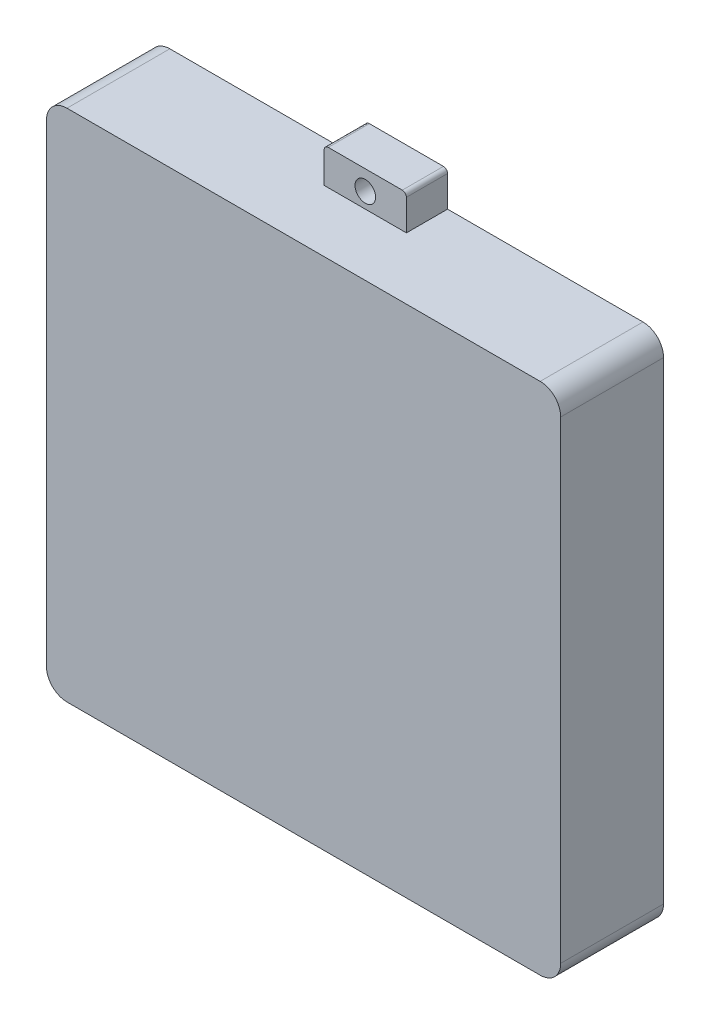
ISO-10303-21;
HEADER;
FILE_DESCRIPTION(('STEP AP214'),'2;1');
FILE_NAME('part.step','',(''),(''),'','','');
FILE_SCHEMA(('AUTOMOTIVE_DESIGN { 1 0 10303 214 1 1 1 1 }'));
ENDSEC;
DATA;
#1=APPLICATION_CONTEXT('core data for automotive mechanical design processes');
#2=APPLICATION_PROTOCOL_DEFINITION('international standard','automotive_design',2000,#1);
#3=PRODUCT_CONTEXT('',#1,'mechanical');
#4=PRODUCT('Part','Part','',(#3));
#5=PRODUCT_RELATED_PRODUCT_CATEGORY('part','',(#4));
#6=PRODUCT_DEFINITION_FORMATION('','',#4);
#7=PRODUCT_DEFINITION_CONTEXT('part definition',#1,'design');
#8=PRODUCT_DEFINITION('design','',#6,#7);
#9=PRODUCT_DEFINITION_SHAPE('','',#8);
#10=(LENGTH_UNIT() NAMED_UNIT(*) SI_UNIT(.MILLI.,.METRE.));
#11=(NAMED_UNIT(*) PLANE_ANGLE_UNIT() SI_UNIT($,.RADIAN.));
#12=(NAMED_UNIT(*) SI_UNIT($,.STERADIAN.) SOLID_ANGLE_UNIT());
#13=UNCERTAINTY_MEASURE_WITH_UNIT(LENGTH_MEASURE(1.E-05),#10,'distance_accuracy_value','');
#14=(GEOMETRIC_REPRESENTATION_CONTEXT(3) GLOBAL_UNCERTAINTY_ASSIGNED_CONTEXT((#13)) GLOBAL_UNIT_ASSIGNED_CONTEXT((#10,
#11,#12)) REPRESENTATION_CONTEXT('',''));
#15=CARTESIAN_POINT('',(0.,0.,0.));
#16=DIRECTION('',(0.,0.,1.));
#17=DIRECTION('',(1.,0.,0.));
#18=AXIS2_PLACEMENT_3D('',#15,#16,#17);
#19=CARTESIAN_POINT('',(0.,250.,50.));
#20=DIRECTION('',(0.,-1.,0.));
#21=DIRECTION('',(0.,0.,-1.));
#22=AXIS2_PLACEMENT_3D('',#19,#20,#21);
#23=PLANE('',#22);
#24=DIRECTION('',(-1.,0.,0.));
#25=VECTOR('',#24,1.);
#26=CARTESIAN_POINT('',(0.,250.,50.));
#27=LINE('',#26,#25);
#28=CARTESIAN_POINT('',(240.,250.,50.));
#29=VERTEX_POINT('',#28);
#30=CARTESIAN_POINT('',(10.,250.,50.));
#31=VERTEX_POINT('',#30);
#32=EDGE_CURVE('E336',#29,#31,#27,.T.);
#33=ORIENTED_EDGE('',*,*,#32,.F.);
#34=DIRECTION('',(0.,0.,-1.));
#35=VECTOR('',#34,1.);
#36=CARTESIAN_POINT('',(240.,250.,50.));
#37=LINE('',#36,#35);
#38=CARTESIAN_POINT('',(240.,250.,0.));
#39=VERTEX_POINT('',#38);
#40=EDGE_CURVE('E367',#29,#39,#37,.T.);
#41=ORIENTED_EDGE('',*,*,#40,.T.);
#42=DIRECTION('',(-1.,0.,0.));
#43=VECTOR('',#42,1.);
#44=CARTESIAN_POINT('',(0.,250.,0.));
#45=LINE('',#44,#43);
#46=CARTESIAN_POINT('',(145.,250.,0.));
#47=VERTEX_POINT('',#46);
#48=EDGE_CURVE('E257',#39,#47,#45,.T.);
#49=ORIENTED_EDGE('',*,*,#48,.T.);
#50=DIRECTION('',(0.,0.,-1.));
#51=VECTOR('',#50,1.);
#52=CARTESIAN_POINT('',(145.,250.,20.));
#53=LINE('',#52,#51);
#54=CARTESIAN_POINT('',(145.,250.,20.));
#55=VERTEX_POINT('',#54);
#56=EDGE_CURVE('E248',#55,#47,#53,.T.);
#57=ORIENTED_EDGE('',*,*,#56,.F.);
#58=DIRECTION('',(-1.,0.,0.));
#59=VECTOR('',#58,1.);
#60=CARTESIAN_POINT('',(145.,250.,20.));
#61=LINE('',#60,#59);
#62=CARTESIAN_POINT('',(105.,250.,20.));
#63=VERTEX_POINT('',#62);
#64=EDGE_CURVE('E229',#55,#63,#61,.T.);
#65=ORIENTED_EDGE('',*,*,#64,.T.);
#66=DIRECTION('',(0.,0.,-1.));
#67=VECTOR('',#66,1.);
#68=CARTESIAN_POINT('',(105.,250.,20.));
#69=LINE('',#68,#67);
#70=CARTESIAN_POINT('',(105.,250.,0.));
#71=VERTEX_POINT('',#70);
#72=EDGE_CURVE('E523',#63,#71,#69,.T.);
#73=ORIENTED_EDGE('',*,*,#72,.T.);
#74=CARTESIAN_POINT('',(10.,250.,0.));
#75=VERTEX_POINT('',#74);
#76=EDGE_CURVE('E352',#71,#75,#45,.T.);
#77=ORIENTED_EDGE('',*,*,#76,.T.);
#78=DIRECTION('',(0.,0.,-1.));
#79=VECTOR('',#78,1.);
#80=CARTESIAN_POINT('',(10.,250.,50.));
#81=LINE('',#80,#79);
#82=EDGE_CURVE('E340',#75,#31,#81,.F.);
#83=ORIENTED_EDGE('',*,*,#82,.T.);
#84=EDGE_LOOP('',(#33,#41,#49,#57,#65,#73,#77,#83));
#85=FACE_BOUND('',#84,.T.);
#86=ADVANCED_FACE('F43',(#85),#23,.F.);
#87=CARTESIAN_POINT('',(0.,0.,50.));
#88=DIRECTION('',(0.,1.,0.));
#89=DIRECTION('',(0.,0.,1.));
#90=AXIS2_PLACEMENT_3D('',#87,#88,#89);
#91=PLANE('',#90);
#92=DIRECTION('',(1.,0.,0.));
#93=VECTOR('',#92,1.);
#94=CARTESIAN_POINT('',(0.,0.,0.));
#95=LINE('',#94,#93);
#96=CARTESIAN_POINT('',(145.,0.,0.));
#97=VERTEX_POINT('',#96);
#98=CARTESIAN_POINT('',(240.,0.,0.));
#99=VERTEX_POINT('',#98);
#100=EDGE_CURVE('E344',#97,#99,#95,.T.);
#101=ORIENTED_EDGE('',*,*,#100,.T.);
#102=DIRECTION('',(0.,0.,-1.));
#103=VECTOR('',#102,1.);
#104=CARTESIAN_POINT('',(240.,0.,50.));
#105=LINE('',#104,#103);
#106=CARTESIAN_POINT('',(240.,0.,50.));
#107=VERTEX_POINT('',#106);
#108=EDGE_CURVE('E405',#99,#107,#105,.F.);
#109=ORIENTED_EDGE('',*,*,#108,.T.);
#110=DIRECTION('',(1.,0.,0.));
#111=VECTOR('',#110,1.);
#112=CARTESIAN_POINT('',(0.,0.,50.));
#113=LINE('',#112,#111);
#114=CARTESIAN_POINT('',(10.,0.,50.));
#115=VERTEX_POINT('',#114);
#116=EDGE_CURVE('E328',#115,#107,#113,.T.);
#117=ORIENTED_EDGE('',*,*,#116,.F.);
#118=DIRECTION('',(0.,0.,-1.));
#119=VECTOR('',#118,1.);
#120=CARTESIAN_POINT('',(10.,0.,50.));
#121=LINE('',#120,#119);
#122=CARTESIAN_POINT('',(10.,0.,0.));
#123=VERTEX_POINT('',#122);
#124=EDGE_CURVE('E401',#115,#123,#121,.T.);
#125=ORIENTED_EDGE('',*,*,#124,.T.);
#126=CARTESIAN_POINT('',(105.,0.,0.));
#127=VERTEX_POINT('',#126);
#128=EDGE_CURVE('E345',#123,#127,#95,.T.);
#129=ORIENTED_EDGE('',*,*,#128,.T.);
#130=DIRECTION('',(0.,0.,-1.));
#131=VECTOR('',#130,1.);
#132=CARTESIAN_POINT('',(105.,0.,20.));
#133=LINE('',#132,#131);
#134=CARTESIAN_POINT('',(105.,0.,20.));
#135=VERTEX_POINT('',#134);
#136=EDGE_CURVE('E319',#135,#127,#133,.T.);
#137=ORIENTED_EDGE('',*,*,#136,.F.);
#138=DIRECTION('',(-1.,0.,0.));
#139=VECTOR('',#138,1.);
#140=CARTESIAN_POINT('',(145.,0.,20.));
#141=LINE('',#140,#139);
#142=CARTESIAN_POINT('',(145.,0.,20.));
#143=VERTEX_POINT('',#142);
#144=EDGE_CURVE('E269',#143,#135,#141,.T.);
#145=ORIENTED_EDGE('',*,*,#144,.F.);
#146=DIRECTION('',(0.,0.,-1.));
#147=VECTOR('',#146,1.);
#148=CARTESIAN_POINT('',(145.,0.,20.));
#149=LINE('',#148,#147);
#150=EDGE_CURVE('E288',#143,#97,#149,.T.);
#151=ORIENTED_EDGE('',*,*,#150,.T.);
#152=EDGE_LOOP('',(#101,#109,#117,#125,#129,#137,#145,#151));
#153=FACE_BOUND('',#152,.T.);
#154=ADVANCED_FACE('F572',(#153),#91,.F.);
#155=CARTESIAN_POINT('',(0.,0.,50.));
#156=DIRECTION('',(1.,0.,0.));
#157=DIRECTION('',(0.,0.,-1.));
#158=AXIS2_PLACEMENT_3D('',#155,#156,#157);
#159=PLANE('',#158);
#160=DIRECTION('',(0.,-1.,0.));
#161=VECTOR('',#160,1.);
#162=CARTESIAN_POINT('',(0.,0.,0.));
#163=LINE('',#162,#161);
#164=CARTESIAN_POINT('',(0.,240.,0.));
#165=VERTEX_POINT('',#164);
#166=CARTESIAN_POINT('',(0.,10.,0.));
#167=VERTEX_POINT('',#166);
#168=EDGE_CURVE('E323',#165,#167,#163,.T.);
#169=ORIENTED_EDGE('',*,*,#168,.T.);
#170=DIRECTION('',(0.,0.,-1.));
#171=VECTOR('',#170,1.);
#172=CARTESIAN_POINT('',(0.,10.,50.));
#173=LINE('',#172,#171);
#174=CARTESIAN_POINT('',(0.,10.,50.));
#175=VERTEX_POINT('',#174);
#176=EDGE_CURVE('E412',#167,#175,#173,.F.);
#177=ORIENTED_EDGE('',*,*,#176,.T.);
#178=DIRECTION('',(0.,-1.,0.));
#179=VECTOR('',#178,1.);
#180=CARTESIAN_POINT('',(0.,0.,50.));
#181=LINE('',#180,#179);
#182=CARTESIAN_POINT('',(0.,240.,50.));
#183=VERTEX_POINT('',#182);
#184=EDGE_CURVE('E324',#183,#175,#181,.T.);
#185=ORIENTED_EDGE('',*,*,#184,.F.);
#186=DIRECTION('',(0.,0.,-1.));
#187=VECTOR('',#186,1.);
#188=CARTESIAN_POINT('',(0.,240.,50.));
#189=LINE('',#188,#187);
#190=EDGE_CURVE('E408',#183,#165,#189,.T.);
#191=ORIENTED_EDGE('',*,*,#190,.T.);
#192=EDGE_LOOP('',(#169,#177,#185,#191));
#193=FACE_BOUND('',#192,.T.);
#194=ADVANCED_FACE('F599',(#193),#159,.F.);
#195=CARTESIAN_POINT('',(250.,0.,50.));
#196=DIRECTION('',(-1.,0.,0.));
#197=DIRECTION('',(0.,0.,1.));
#198=AXIS2_PLACEMENT_3D('',#195,#196,#197);
#199=PLANE('',#198);
#200=DIRECTION('',(0.,1.,0.));
#201=VECTOR('',#200,1.);
#202=CARTESIAN_POINT('',(250.,0.,0.));
#203=LINE('',#202,#201);
#204=CARTESIAN_POINT('',(250.,10.,0.));
#205=VERTEX_POINT('',#204);
#206=CARTESIAN_POINT('',(250.,240.,0.));
#207=VERTEX_POINT('',#206);
#208=EDGE_CURVE('E348',#205,#207,#203,.T.);
#209=ORIENTED_EDGE('',*,*,#208,.T.);
#210=DIRECTION('',(0.,0.,-1.));
#211=VECTOR('',#210,1.);
#212=CARTESIAN_POINT('',(250.,240.,50.));
#213=LINE('',#212,#211);
#214=CARTESIAN_POINT('',(250.,240.,50.));
#215=VERTEX_POINT('',#214);
#216=EDGE_CURVE('E386',#207,#215,#213,.F.);
#217=ORIENTED_EDGE('',*,*,#216,.T.);
#218=DIRECTION('',(0.,1.,0.));
#219=VECTOR('',#218,1.);
#220=CARTESIAN_POINT('',(250.,0.,50.));
#221=LINE('',#220,#219);
#222=CARTESIAN_POINT('',(250.,10.,50.));
#223=VERTEX_POINT('',#222);
#224=EDGE_CURVE('E332',#223,#215,#221,.T.);
#225=ORIENTED_EDGE('',*,*,#224,.F.);
#226=DIRECTION('',(0.,0.,-1.));
#227=VECTOR('',#226,1.);
#228=CARTESIAN_POINT('',(250.,10.,50.));
#229=LINE('',#228,#227);
#230=EDGE_CURVE('E382',#223,#205,#229,.T.);
#231=ORIENTED_EDGE('',*,*,#230,.T.);
#232=EDGE_LOOP('',(#209,#217,#225,#231));
#233=FACE_BOUND('',#232,.T.);
#234=ADVANCED_FACE('F586',(#233),#199,.F.);
#235=CARTESIAN_POINT('',(0.,0.,50.));
#236=DIRECTION('',(0.,0.,-1.));
#237=DIRECTION('',(-1.,0.,0.));
#238=AXIS2_PLACEMENT_3D('',#235,#236,#237);
#239=PLANE('',#238);
#240=ORIENTED_EDGE('',*,*,#224,.T.);
#241=CARTESIAN_POINT('',(240.,240.,50.));
#242=DIRECTION('',(0.,0.,-1.));
#243=DIRECTION('',(-1.,0.,0.));
#244=AXIS2_PLACEMENT_3D('',#241,#242,#243);
#245=CIRCLE('',#244,10.);
#246=EDGE_CURVE('E398',#215,#29,#245,.F.);
#247=ORIENTED_EDGE('',*,*,#246,.T.);
#248=ORIENTED_EDGE('',*,*,#32,.T.);
#249=CARTESIAN_POINT('',(10.,240.,50.));
#250=DIRECTION('',(0.,0.,-1.));
#251=DIRECTION('',(-1.,0.,0.));
#252=AXIS2_PLACEMENT_3D('',#249,#250,#251);
#253=CIRCLE('',#252,10.);
#254=EDGE_CURVE('E389',#31,#183,#253,.F.);
#255=ORIENTED_EDGE('',*,*,#254,.T.);
#256=ORIENTED_EDGE('',*,*,#184,.T.);
#257=CARTESIAN_POINT('',(10.,10.,50.));
#258=DIRECTION('',(0.,0.,-1.));
#259=DIRECTION('',(-1.,0.,0.));
#260=AXIS2_PLACEMENT_3D('',#257,#258,#259);
#261=CIRCLE('',#260,10.);
#262=EDGE_CURVE('E392',#175,#115,#261,.F.);
#263=ORIENTED_EDGE('',*,*,#262,.T.);
#264=ORIENTED_EDGE('',*,*,#116,.T.);
#265=CARTESIAN_POINT('',(240.,10.,50.));
#266=DIRECTION('',(0.,0.,-1.));
#267=DIRECTION('',(-1.,0.,0.));
#268=AXIS2_PLACEMENT_3D('',#265,#266,#267);
#269=CIRCLE('',#268,10.);
#270=EDGE_CURVE('E395',#107,#223,#269,.F.);
#271=ORIENTED_EDGE('',*,*,#270,.T.);
#272=EDGE_LOOP('',(#240,#247,#248,#255,#256,#263,#264,#271));
#273=FACE_BOUND('',#272,.T.);
#274=ADVANCED_FACE('F583',(#273),#239,.F.);
#275=CARTESIAN_POINT('',(0.,0.,0.));
#276=DIRECTION('',(0.,0.,-1.));
#277=DIRECTION('',(-1.,0.,0.));
#278=AXIS2_PLACEMENT_3D('',#275,#276,#277);
#279=PLANE('',#278);
#280=DIRECTION('',(1.,0.,0.));
#281=VECTOR('',#280,1.);
#282=CARTESIAN_POINT('',(246.,246.,0.));
#283=LINE('',#282,#281);
#284=CARTESIAN_POINT('',(14.,246.,0.));
#285=VERTEX_POINT('',#284);
#286=CARTESIAN_POINT('',(236.,246.,0.));
#287=VERTEX_POINT('',#286);
#288=EDGE_CURVE('E498',#285,#287,#283,.T.);
#289=ORIENTED_EDGE('',*,*,#288,.F.);
#290=CARTESIAN_POINT('',(14.,236.,0.));
#291=DIRECTION('',(0.,0.,-1.));
#292=DIRECTION('',(-1.,0.,0.));
#293=AXIS2_PLACEMENT_3D('',#290,#291,#292);
#294=CIRCLE('',#293,10.);
#295=CARTESIAN_POINT('',(4.,236.,0.));
#296=VERTEX_POINT('',#295);
#297=EDGE_CURVE('E11',#285,#296,#294,.F.);
#298=ORIENTED_EDGE('',*,*,#297,.T.);
#299=DIRECTION('',(0.,1.,0.));
#300=VECTOR('',#299,1.);
#301=CARTESIAN_POINT('',(4.,246.,0.));
#302=LINE('',#301,#300);
#303=CARTESIAN_POINT('',(4.,14.,0.));
#304=VERTEX_POINT('',#303);
#305=EDGE_CURVE('E465',#304,#296,#302,.T.);
#306=ORIENTED_EDGE('',*,*,#305,.F.);
#307=CARTESIAN_POINT('',(14.,14.,0.));
#308=DIRECTION('',(0.,0.,-1.));
#309=DIRECTION('',(-1.,0.,0.));
#310=AXIS2_PLACEMENT_3D('',#307,#308,#309);
#311=CIRCLE('',#310,10.);
#312=CARTESIAN_POINT('',(14.,4.,0.));
#313=VERTEX_POINT('',#312);
#314=EDGE_CURVE('E52',#304,#313,#311,.F.);
#315=ORIENTED_EDGE('',*,*,#314,.T.);
#316=DIRECTION('',(-1.,0.,0.));
#317=VECTOR('',#316,1.);
#318=CARTESIAN_POINT('',(246.,4.,0.));
#319=LINE('',#318,#317);
#320=CARTESIAN_POINT('',(236.,4.,0.));
#321=VERTEX_POINT('',#320);
#322=EDGE_CURVE('E464',#321,#313,#319,.T.);
#323=ORIENTED_EDGE('',*,*,#322,.F.);
#324=CARTESIAN_POINT('',(236.,14.,0.));
#325=DIRECTION('',(0.,0.,-1.));
#326=DIRECTION('',(-1.,0.,0.));
#327=AXIS2_PLACEMENT_3D('',#324,#325,#326);
#328=CIRCLE('',#327,10.);
#329=CARTESIAN_POINT('',(246.,14.,0.));
#330=VERTEX_POINT('',#329);
#331=EDGE_CURVE('E454',#321,#330,#328,.F.);
#332=ORIENTED_EDGE('',*,*,#331,.T.);
#333=DIRECTION('',(0.,-1.,0.));
#334=VECTOR('',#333,1.);
#335=CARTESIAN_POINT('',(246.,246.,0.));
#336=LINE('',#335,#334);
#337=CARTESIAN_POINT('',(246.,236.,0.));
#338=VERTEX_POINT('',#337);
#339=EDGE_CURVE('E472',#338,#330,#336,.T.);
#340=ORIENTED_EDGE('',*,*,#339,.F.);
#341=CARTESIAN_POINT('',(236.,236.,0.));
#342=DIRECTION('',(0.,0.,-1.));
#343=DIRECTION('',(-1.,0.,0.));
#344=AXIS2_PLACEMENT_3D('',#341,#342,#343);
#345=CIRCLE('',#344,10.);
#346=EDGE_CURVE('E457',#338,#287,#345,.F.);
#347=ORIENTED_EDGE('',*,*,#346,.T.);
#348=EDGE_LOOP('',(#289,#298,#306,#315,#323,#332,#340,#347));
#349=FACE_BOUND('',#348,.T.);
#350=CARTESIAN_POINT('',(125.,-7.5,0.));
#351=DIRECTION('',(0.,0.,-1.));
#352=DIRECTION('',(-1.,0.,0.));
#353=AXIS2_PLACEMENT_3D('',#350,#351,#352);
#354=CIRCLE('',#353,5.);
#355=CARTESIAN_POINT('',(120.,-7.5,0.));
#356=VERTEX_POINT('',#355);
#357=EDGE_CURVE('E360',#356,#356,#354,.T.);
#358=ORIENTED_EDGE('',*,*,#357,.F.);
#359=EDGE_LOOP('',(#358));
#360=FACE_BOUND('',#359,.T.);
#361=CARTESIAN_POINT('',(125.,257.5,0.));
#362=DIRECTION('',(0.,0.,-1.));
#363=DIRECTION('',(1.,0.,0.));
#364=AXIS2_PLACEMENT_3D('',#361,#362,#363);
#365=CIRCLE('',#364,5.00000000000001);
#366=CARTESIAN_POINT('',(130.,257.5,0.));
#367=VERTEX_POINT('',#366);
#368=EDGE_CURVE('E488',#367,#367,#365,.T.);
#369=ORIENTED_EDGE('',*,*,#368,.F.);
#370=EDGE_LOOP('',(#369));
#371=FACE_BOUND('',#370,.T.);
#372=ORIENTED_EDGE('',*,*,#48,.F.);
#373=CARTESIAN_POINT('',(240.,240.,0.));
#374=DIRECTION('',(0.,0.,-1.));
#375=DIRECTION('',(-1.,0.,0.));
#376=AXIS2_PLACEMENT_3D('',#373,#374,#375);
#377=CIRCLE('',#376,10.);
#378=EDGE_CURVE('E379',#39,#207,#377,.T.);
#379=ORIENTED_EDGE('',*,*,#378,.T.);
#380=ORIENTED_EDGE('',*,*,#208,.F.);
#381=CARTESIAN_POINT('',(240.,10.,0.));
#382=DIRECTION('',(0.,0.,-1.));
#383=DIRECTION('',(-1.,0.,0.));
#384=AXIS2_PLACEMENT_3D('',#381,#382,#383);
#385=CIRCLE('',#384,10.);
#386=EDGE_CURVE('E376',#205,#99,#385,.T.);
#387=ORIENTED_EDGE('',*,*,#386,.T.);
#388=ORIENTED_EDGE('',*,*,#100,.F.);
#389=DIRECTION('',(0.,1.,0.));
#390=VECTOR('',#389,1.);
#391=CARTESIAN_POINT('',(145.,0.,0.));
#392=LINE('',#391,#390);
#393=CARTESIAN_POINT('',(145.,-15.,0.));
#394=VERTEX_POINT('',#393);
#395=EDGE_CURVE('E274',#394,#97,#392,.T.);
#396=ORIENTED_EDGE('',*,*,#395,.F.);
#397=CARTESIAN_POINT('',(143.,-15.,0.));
#398=DIRECTION('',(0.,0.,1.));
#399=DIRECTION('',(-1.,0.,0.));
#400=AXIS2_PLACEMENT_3D('',#397,#398,#399);
#401=CIRCLE('',#400,2.);
#402=CARTESIAN_POINT('',(143.,-17.,0.));
#403=VERTEX_POINT('',#402);
#404=EDGE_CURVE('E295',#403,#394,#401,.T.);
#405=ORIENTED_EDGE('',*,*,#404,.F.);
#406=DIRECTION('',(1.,0.,0.));
#407=VECTOR('',#406,1.);
#408=CARTESIAN_POINT('',(107.,-17.,0.));
#409=LINE('',#408,#407);
#410=CARTESIAN_POINT('',(107.,-17.,0.));
#411=VERTEX_POINT('',#410);
#412=EDGE_CURVE('E292',#411,#403,#409,.T.);
#413=ORIENTED_EDGE('',*,*,#412,.F.);
#414=CARTESIAN_POINT('',(107.,-15.,0.));
#415=DIRECTION('',(0.,0.,1.));
#416=DIRECTION('',(-1.,0.,0.));
#417=AXIS2_PLACEMENT_3D('',#414,#415,#416);
#418=CIRCLE('',#417,2.);
#419=CARTESIAN_POINT('',(105.,-15.,0.));
#420=VERTEX_POINT('',#419);
#421=EDGE_CURVE('E263',#420,#411,#418,.T.);
#422=ORIENTED_EDGE('',*,*,#421,.F.);
#423=DIRECTION('',(0.,-1.,0.));
#424=VECTOR('',#423,1.);
#425=CARTESIAN_POINT('',(105.,0.,0.));
#426=LINE('',#425,#424);
#427=EDGE_CURVE('E259',#127,#420,#426,.T.);
#428=ORIENTED_EDGE('',*,*,#427,.F.);
#429=ORIENTED_EDGE('',*,*,#128,.F.);
#430=CARTESIAN_POINT('',(10.,10.,0.));
#431=DIRECTION('',(0.,0.,-1.));
#432=DIRECTION('',(-1.,0.,0.));
#433=AXIS2_PLACEMENT_3D('',#430,#431,#432);
#434=CIRCLE('',#433,10.);
#435=EDGE_CURVE('E373',#123,#167,#434,.T.);
#436=ORIENTED_EDGE('',*,*,#435,.T.);
#437=ORIENTED_EDGE('',*,*,#168,.F.);
#438=CARTESIAN_POINT('',(10.,240.,0.));
#439=DIRECTION('',(0.,0.,-1.));
#440=DIRECTION('',(-1.,0.,0.));
#441=AXIS2_PLACEMENT_3D('',#438,#439,#440);
#442=CIRCLE('',#441,10.);
#443=EDGE_CURVE('E370',#165,#75,#442,.T.);
#444=ORIENTED_EDGE('',*,*,#443,.T.);
#445=ORIENTED_EDGE('',*,*,#76,.F.);
#446=DIRECTION('',(0.,1.,0.));
#447=VECTOR('',#446,1.);
#448=CARTESIAN_POINT('',(105.,250.,0.));
#449=LINE('',#448,#447);
#450=CARTESIAN_POINT('',(105.,265.,0.));
#451=VERTEX_POINT('',#450);
#452=EDGE_CURVE('E242',#71,#451,#449,.T.);
#453=ORIENTED_EDGE('',*,*,#452,.T.);
#454=CARTESIAN_POINT('',(107.,265.,0.));
#455=DIRECTION('',(0.,0.,-1.));
#456=DIRECTION('',(-1.,0.,0.));
#457=AXIS2_PLACEMENT_3D('',#454,#455,#456);
#458=CIRCLE('',#457,2.);
#459=CARTESIAN_POINT('',(107.,267.,0.));
#460=VERTEX_POINT('',#459);
#461=EDGE_CURVE('E534',#451,#460,#458,.T.);
#462=ORIENTED_EDGE('',*,*,#461,.T.);
#463=DIRECTION('',(1.,0.,0.));
#464=VECTOR('',#463,1.);
#465=CARTESIAN_POINT('',(107.,267.,0.));
#466=LINE('',#465,#464);
#467=CARTESIAN_POINT('',(143.,267.,0.));
#468=VERTEX_POINT('',#467);
#469=EDGE_CURVE('E530',#460,#468,#466,.T.);
#470=ORIENTED_EDGE('',*,*,#469,.T.);
#471=CARTESIAN_POINT('',(143.,265.,0.));
#472=DIRECTION('',(0.,0.,-1.));
#473=DIRECTION('',(-1.,0.,0.));
#474=AXIS2_PLACEMENT_3D('',#471,#472,#473);
#475=CIRCLE('',#474,2.);
#476=CARTESIAN_POINT('',(145.,265.,0.));
#477=VERTEX_POINT('',#476);
#478=EDGE_CURVE('E526',#468,#477,#475,.T.);
#479=ORIENTED_EDGE('',*,*,#478,.T.);
#480=DIRECTION('',(0.,-1.,0.));
#481=VECTOR('',#480,1.);
#482=CARTESIAN_POINT('',(145.,250.,0.));
#483=LINE('',#482,#481);
#484=EDGE_CURVE('E364',#477,#47,#483,.T.);
#485=ORIENTED_EDGE('',*,*,#484,.T.);
#486=EDGE_LOOP('',(#372,#379,#380,#387,#388,#396,#405,#413,#422,#428,#429,#436,#437,#444,#445,
#453,#462,#470,#479,#485));
#487=FACE_BOUND('',#486,.T.);
#488=ADVANCED_FACE('F462',(#349,#360,#371,#487),#279,.T.);
#489=CARTESIAN_POINT('',(105.,0.,20.));
#490=DIRECTION('',(1.,0.,0.));
#491=DIRECTION('',(0.,0.,-1.));
#492=AXIS2_PLACEMENT_3D('',#489,#490,#491);
#493=PLANE('',#492);
#494=ORIENTED_EDGE('',*,*,#427,.T.);
#495=DIRECTION('',(0.,0.,-1.));
#496=VECTOR('',#495,1.);
#497=CARTESIAN_POINT('',(105.,-15.,20.));
#498=LINE('',#497,#496);
#499=CARTESIAN_POINT('',(105.,-15.,20.));
#500=VERTEX_POINT('',#499);
#501=EDGE_CURVE('E315',#500,#420,#498,.T.);
#502=ORIENTED_EDGE('',*,*,#501,.F.);
#503=DIRECTION('',(0.,-1.,0.));
#504=VECTOR('',#503,1.);
#505=CARTESIAN_POINT('',(105.,0.,20.));
#506=LINE('',#505,#504);
#507=EDGE_CURVE('E273',#135,#500,#506,.T.);
#508=ORIENTED_EDGE('',*,*,#507,.F.);
#509=ORIENTED_EDGE('',*,*,#136,.T.);
#510=EDGE_LOOP('',(#494,#502,#508,#509));
#511=FACE_BOUND('',#510,.T.);
#512=ADVANCED_FACE('F611',(#511),#493,.F.);
#513=CARTESIAN_POINT('',(107.,-15.,20.));
#514=DIRECTION('',(0.,0.,-1.));
#515=DIRECTION('',(-1.,0.,0.));
#516=AXIS2_PLACEMENT_3D('',#513,#514,#515);
#517=CYLINDRICAL_SURFACE('',#516,2.);
#518=ORIENTED_EDGE('',*,*,#421,.T.);
#519=DIRECTION('',(0.,0.,-1.));
#520=VECTOR('',#519,1.);
#521=CARTESIAN_POINT('',(107.,-17.,20.));
#522=LINE('',#521,#520);
#523=CARTESIAN_POINT('',(107.,-17.,20.));
#524=VERTEX_POINT('',#523);
#525=EDGE_CURVE('E311',#524,#411,#522,.T.);
#526=ORIENTED_EDGE('',*,*,#525,.F.);
#527=CARTESIAN_POINT('',(107.,-15.,20.));
#528=DIRECTION('',(0.,0.,1.));
#529=DIRECTION('',(-1.,0.,0.));
#530=AXIS2_PLACEMENT_3D('',#527,#528,#529);
#531=CIRCLE('',#530,2.);
#532=EDGE_CURVE('E277',#500,#524,#531,.T.);
#533=ORIENTED_EDGE('',*,*,#532,.F.);
#534=ORIENTED_EDGE('',*,*,#501,.T.);
#535=EDGE_LOOP('',(#518,#526,#533,#534));
#536=FACE_BOUND('',#535,.T.);
#537=ADVANCED_FACE('F629',(#536),#517,.T.);
#538=CARTESIAN_POINT('',(107.,-17.,20.));
#539=DIRECTION('',(0.,1.,0.));
#540=DIRECTION('',(0.,0.,1.));
#541=AXIS2_PLACEMENT_3D('',#538,#539,#540);
#542=PLANE('',#541);
#543=ORIENTED_EDGE('',*,*,#412,.T.);
#544=DIRECTION('',(0.,0.,-1.));
#545=VECTOR('',#544,1.);
#546=CARTESIAN_POINT('',(143.,-17.,20.));
#547=LINE('',#546,#545);
#548=CARTESIAN_POINT('',(143.,-17.,20.));
#549=VERTEX_POINT('',#548);
#550=EDGE_CURVE('E307',#549,#403,#547,.T.);
#551=ORIENTED_EDGE('',*,*,#550,.F.);
#552=DIRECTION('',(1.,0.,0.));
#553=VECTOR('',#552,1.);
#554=CARTESIAN_POINT('',(107.,-17.,20.));
#555=LINE('',#554,#553);
#556=EDGE_CURVE('E280',#524,#549,#555,.T.);
#557=ORIENTED_EDGE('',*,*,#556,.F.);
#558=ORIENTED_EDGE('',*,*,#525,.T.);
#559=EDGE_LOOP('',(#543,#551,#557,#558));
#560=FACE_BOUND('',#559,.T.);
#561=ADVANCED_FACE('F625',(#560),#542,.F.);
#562=CARTESIAN_POINT('',(143.,-15.,20.));
#563=DIRECTION('',(0.,0.,-1.));
#564=DIRECTION('',(-1.,0.,0.));
#565=AXIS2_PLACEMENT_3D('',#562,#563,#564);
#566=CYLINDRICAL_SURFACE('',#565,2.);
#567=ORIENTED_EDGE('',*,*,#404,.T.);
#568=DIRECTION('',(0.,0.,-1.));
#569=VECTOR('',#568,1.);
#570=CARTESIAN_POINT('',(145.,-15.,20.));
#571=LINE('',#570,#569);
#572=CARTESIAN_POINT('',(145.,-15.,20.));
#573=VERTEX_POINT('',#572);
#574=EDGE_CURVE('E303',#573,#394,#571,.T.);
#575=ORIENTED_EDGE('',*,*,#574,.F.);
#576=CARTESIAN_POINT('',(143.,-15.,20.));
#577=DIRECTION('',(0.,0.,1.));
#578=DIRECTION('',(-1.,0.,0.));
#579=AXIS2_PLACEMENT_3D('',#576,#577,#578);
#580=CIRCLE('',#579,2.);
#581=EDGE_CURVE('E283',#549,#573,#580,.T.);
#582=ORIENTED_EDGE('',*,*,#581,.F.);
#583=ORIENTED_EDGE('',*,*,#550,.T.);
#584=EDGE_LOOP('',(#567,#575,#582,#583));
#585=FACE_BOUND('',#584,.T.);
#586=ADVANCED_FACE('F621',(#585),#566,.T.);
#587=CARTESIAN_POINT('',(145.,0.,20.));
#588=DIRECTION('',(-1.,0.,0.));
#589=DIRECTION('',(0.,0.,1.));
#590=AXIS2_PLACEMENT_3D('',#587,#588,#589);
#591=PLANE('',#590);
#592=ORIENTED_EDGE('',*,*,#395,.T.);
#593=ORIENTED_EDGE('',*,*,#150,.F.);
#594=DIRECTION('',(0.,1.,0.));
#595=VECTOR('',#594,1.);
#596=CARTESIAN_POINT('',(145.,0.,20.));
#597=LINE('',#596,#595);
#598=EDGE_CURVE('E286',#573,#143,#597,.T.);
#599=ORIENTED_EDGE('',*,*,#598,.F.);
#600=ORIENTED_EDGE('',*,*,#574,.T.);
#601=EDGE_LOOP('',(#592,#593,#599,#600));
#602=FACE_BOUND('',#601,.T.);
#603=ADVANCED_FACE('F618',(#602),#591,.F.);
#604=CARTESIAN_POINT('',(107.,-15.,20.));
#605=DIRECTION('',(0.,0.,-1.));
#606=DIRECTION('',(-1.,0.,0.));
#607=AXIS2_PLACEMENT_3D('',#604,#605,#606);
#608=PLANE('',#607);
#609=CARTESIAN_POINT('',(125.,-7.5,20.));
#610=DIRECTION('',(0.,0.,-1.));
#611=DIRECTION('',(-1.,0.,0.));
#612=AXIS2_PLACEMENT_3D('',#609,#610,#611);
#613=CIRCLE('',#612,5.);
#614=CARTESIAN_POINT('',(120.,-7.5,20.));
#615=VERTEX_POINT('',#614);
#616=EDGE_CURVE('E359',#615,#615,#613,.T.);
#617=ORIENTED_EDGE('',*,*,#616,.T.);
#618=EDGE_LOOP('',(#617));
#619=FACE_BOUND('',#618,.T.);
#620=ORIENTED_EDGE('',*,*,#144,.T.);
#621=ORIENTED_EDGE('',*,*,#507,.T.);
#622=ORIENTED_EDGE('',*,*,#532,.T.);
#623=ORIENTED_EDGE('',*,*,#556,.T.);
#624=ORIENTED_EDGE('',*,*,#581,.T.);
#625=ORIENTED_EDGE('',*,*,#598,.T.);
#626=EDGE_LOOP('',(#620,#621,#622,#623,#624,#625));
#627=FACE_BOUND('',#626,.T.);
#628=ADVANCED_FACE('F613',(#619,#627),#608,.F.);
#629=CARTESIAN_POINT('',(145.,250.,20.));
#630=DIRECTION('',(1.,0.,0.));
#631=DIRECTION('',(0.,0.,-1.));
#632=AXIS2_PLACEMENT_3D('',#629,#630,#631);
#633=PLANE('',#632);
#634=ORIENTED_EDGE('',*,*,#484,.F.);
#635=DIRECTION('',(0.,0.,-1.));
#636=VECTOR('',#635,1.);
#637=CARTESIAN_POINT('',(145.,265.,20.));
#638=LINE('',#637,#636);
#639=CARTESIAN_POINT('',(145.,265.,20.));
#640=VERTEX_POINT('',#639);
#641=EDGE_CURVE('E250',#640,#477,#638,.T.);
#642=ORIENTED_EDGE('',*,*,#641,.F.);
#643=DIRECTION('',(0.,-1.,0.));
#644=VECTOR('',#643,1.);
#645=CARTESIAN_POINT('',(145.,250.,20.));
#646=LINE('',#645,#644);
#647=EDGE_CURVE('E233',#640,#55,#646,.T.);
#648=ORIENTED_EDGE('',*,*,#647,.T.);
#649=ORIENTED_EDGE('',*,*,#56,.T.);
#650=EDGE_LOOP('',(#634,#642,#648,#649));
#651=FACE_BOUND('',#650,.T.);
#652=ADVANCED_FACE('F247',(#651),#633,.T.);
#653=CARTESIAN_POINT('',(143.,265.,20.));
#654=DIRECTION('',(0.,0.,-1.));
#655=DIRECTION('',(-1.,0.,0.));
#656=AXIS2_PLACEMENT_3D('',#653,#654,#655);
#657=CYLINDRICAL_SURFACE('',#656,2.);
#658=ORIENTED_EDGE('',*,*,#478,.F.);
#659=DIRECTION('',(0.,0.,-1.));
#660=VECTOR('',#659,1.);
#661=CARTESIAN_POINT('',(143.,267.,20.));
#662=LINE('',#661,#660);
#663=CARTESIAN_POINT('',(143.,267.,20.));
#664=VERTEX_POINT('',#663);
#665=EDGE_CURVE('E265',#664,#468,#662,.T.);
#666=ORIENTED_EDGE('',*,*,#665,.F.);
#667=CARTESIAN_POINT('',(143.,265.,20.));
#668=DIRECTION('',(0.,0.,-1.));
#669=DIRECTION('',(-1.,0.,0.));
#670=AXIS2_PLACEMENT_3D('',#667,#668,#669);
#671=CIRCLE('',#670,2.);
#672=EDGE_CURVE('E252',#664,#640,#671,.T.);
#673=ORIENTED_EDGE('',*,*,#672,.T.);
#674=ORIENTED_EDGE('',*,*,#641,.T.);
#675=EDGE_LOOP('',(#658,#666,#673,#674));
#676=FACE_BOUND('',#675,.T.);
#677=ADVANCED_FACE('F555',(#676),#657,.T.);
#678=CARTESIAN_POINT('',(107.,267.,20.));
#679=DIRECTION('',(0.,1.,0.));
#680=DIRECTION('',(0.,0.,1.));
#681=AXIS2_PLACEMENT_3D('',#678,#679,#680);
#682=PLANE('',#681);
#683=ORIENTED_EDGE('',*,*,#469,.F.);
#684=DIRECTION('',(0.,0.,-1.));
#685=VECTOR('',#684,1.);
#686=CARTESIAN_POINT('',(107.,267.,20.));
#687=LINE('',#686,#685);
#688=CARTESIAN_POINT('',(107.,267.,20.));
#689=VERTEX_POINT('',#688);
#690=EDGE_CURVE('E546',#689,#460,#687,.T.);
#691=ORIENTED_EDGE('',*,*,#690,.F.);
#692=DIRECTION('',(1.,0.,0.));
#693=VECTOR('',#692,1.);
#694=CARTESIAN_POINT('',(107.,267.,20.));
#695=LINE('',#694,#693);
#696=EDGE_CURVE('E513',#689,#664,#695,.T.);
#697=ORIENTED_EDGE('',*,*,#696,.T.);
#698=ORIENTED_EDGE('',*,*,#665,.T.);
#699=EDGE_LOOP('',(#683,#691,#697,#698));
#700=FACE_BOUND('',#699,.T.);
#701=ADVANCED_FACE('F552',(#700),#682,.T.);
#702=CARTESIAN_POINT('',(107.,265.,20.));
#703=DIRECTION('',(0.,0.,-1.));
#704=DIRECTION('',(-1.,0.,0.));
#705=AXIS2_PLACEMENT_3D('',#702,#703,#704);
#706=CYLINDRICAL_SURFACE('',#705,2.);
#707=ORIENTED_EDGE('',*,*,#461,.F.);
#708=DIRECTION('',(0.,0.,-1.));
#709=VECTOR('',#708,1.);
#710=CARTESIAN_POINT('',(105.,265.,20.));
#711=LINE('',#710,#709);
#712=CARTESIAN_POINT('',(105.,265.,20.));
#713=VERTEX_POINT('',#712);
#714=EDGE_CURVE('E543',#713,#451,#711,.T.);
#715=ORIENTED_EDGE('',*,*,#714,.F.);
#716=CARTESIAN_POINT('',(107.,265.,20.));
#717=DIRECTION('',(0.,0.,-1.));
#718=DIRECTION('',(-1.,0.,0.));
#719=AXIS2_PLACEMENT_3D('',#716,#717,#718);
#720=CIRCLE('',#719,2.);
#721=EDGE_CURVE('E517',#713,#689,#720,.T.);
#722=ORIENTED_EDGE('',*,*,#721,.T.);
#723=ORIENTED_EDGE('',*,*,#690,.T.);
#724=EDGE_LOOP('',(#707,#715,#722,#723));
#725=FACE_BOUND('',#724,.T.);
#726=ADVANCED_FACE('F560',(#725),#706,.T.);
#727=CARTESIAN_POINT('',(105.,250.,20.));
#728=DIRECTION('',(-1.,0.,0.));
#729=DIRECTION('',(0.,0.,1.));
#730=AXIS2_PLACEMENT_3D('',#727,#728,#729);
#731=PLANE('',#730);
#732=ORIENTED_EDGE('',*,*,#452,.F.);
#733=ORIENTED_EDGE('',*,*,#72,.F.);
#734=DIRECTION('',(0.,1.,0.));
#735=VECTOR('',#734,1.);
#736=CARTESIAN_POINT('',(105.,250.,20.));
#737=LINE('',#736,#735);
#738=EDGE_CURVE('E237',#63,#713,#737,.T.);
#739=ORIENTED_EDGE('',*,*,#738,.T.);
#740=ORIENTED_EDGE('',*,*,#714,.T.);
#741=EDGE_LOOP('',(#732,#733,#739,#740));
#742=FACE_BOUND('',#741,.T.);
#743=ADVANCED_FACE('F562',(#742),#731,.T.);
#744=CARTESIAN_POINT('',(107.,265.,20.));
#745=DIRECTION('',(0.,0.,-1.));
#746=DIRECTION('',(-1.,0.,0.));
#747=AXIS2_PLACEMENT_3D('',#744,#745,#746);
#748=PLANE('',#747);
#749=CARTESIAN_POINT('',(125.,257.5,20.));
#750=DIRECTION('',(0.,0.,-1.));
#751=DIRECTION('',(-1.,0.,0.));
#752=AXIS2_PLACEMENT_3D('',#749,#750,#751);
#753=CIRCLE('',#752,5.00000000000001);
#754=CARTESIAN_POINT('',(120.,257.5,20.));
#755=VERTEX_POINT('',#754);
#756=EDGE_CURVE('E355',#755,#755,#753,.T.);
#757=ORIENTED_EDGE('',*,*,#756,.T.);
#758=EDGE_LOOP('',(#757));
#759=FACE_BOUND('',#758,.T.);
#760=ORIENTED_EDGE('',*,*,#64,.F.);
#761=ORIENTED_EDGE('',*,*,#647,.F.);
#762=ORIENTED_EDGE('',*,*,#672,.F.);
#763=ORIENTED_EDGE('',*,*,#696,.F.);
#764=ORIENTED_EDGE('',*,*,#721,.F.);
#765=ORIENTED_EDGE('',*,*,#738,.F.);
#766=EDGE_LOOP('',(#760,#761,#762,#763,#764,#765));
#767=FACE_BOUND('',#766,.T.);
#768=ADVANCED_FACE('F231',(#759,#767),#748,.F.);
#769=CARTESIAN_POINT('',(125.,257.5,25.));
#770=DIRECTION('',(0.,0.,-1.));
#771=DIRECTION('',(-1.,0.,0.));
#772=AXIS2_PLACEMENT_3D('',#769,#770,#771);
#773=CYLINDRICAL_SURFACE('',#772,5.00000000000001);
#774=ORIENTED_EDGE('',*,*,#368,.T.);
#775=EDGE_LOOP('',(#774));
#776=FACE_BOUND('',#775,.T.);
#777=ORIENTED_EDGE('',*,*,#756,.F.);
#778=EDGE_LOOP('',(#777));
#779=FACE_BOUND('',#778,.T.);
#780=ADVANCED_FACE('F705',(#776,#779),#773,.F.);
#781=CARTESIAN_POINT('',(125.,-7.5,25.));
#782=DIRECTION('',(0.,0.,-1.));
#783=DIRECTION('',(-1.,0.,0.));
#784=AXIS2_PLACEMENT_3D('',#781,#782,#783);
#785=CYLINDRICAL_SURFACE('',#784,5.);
#786=ORIENTED_EDGE('',*,*,#357,.T.);
#787=EDGE_LOOP('',(#786));
#788=FACE_BOUND('',#787,.T.);
#789=ORIENTED_EDGE('',*,*,#616,.F.);
#790=EDGE_LOOP('',(#789));
#791=FACE_BOUND('',#790,.T.);
#792=ADVANCED_FACE('F702',(#788,#791),#785,.F.);
#793=CARTESIAN_POINT('',(246.,246.,46.));
#794=DIRECTION('',(0.,1.,0.));
#795=DIRECTION('',(0.,0.,1.));
#796=AXIS2_PLACEMENT_3D('',#793,#794,#795);
#797=PLANE('',#796);
#798=ORIENTED_EDGE('',*,*,#288,.T.);
#799=DIRECTION('',(0.,0.,-1.));
#800=VECTOR('',#799,1.);
#801=CARTESIAN_POINT('',(236.,246.,46.));
#802=LINE('',#801,#800);
#803=CARTESIAN_POINT('',(236.,246.,46.));
#804=VERTEX_POINT('',#803);
#805=EDGE_CURVE('E445',#287,#804,#802,.F.);
#806=ORIENTED_EDGE('',*,*,#805,.T.);
#807=DIRECTION('',(1.,0.,0.));
#808=VECTOR('',#807,1.);
#809=CARTESIAN_POINT('',(246.,246.,46.));
#810=LINE('',#809,#808);
#811=CARTESIAN_POINT('',(14.,246.,46.));
#812=VERTEX_POINT('',#811);
#813=EDGE_CURVE('E507',#812,#804,#810,.T.);
#814=ORIENTED_EDGE('',*,*,#813,.F.);
#815=DIRECTION('',(0.,0.,-1.));
#816=VECTOR('',#815,1.);
#817=CARTESIAN_POINT('',(14.,246.,0.));
#818=LINE('',#817,#816);
#819=EDGE_CURVE('E441',#812,#285,#818,.T.);
#820=ORIENTED_EDGE('',*,*,#819,.T.);
#821=EDGE_LOOP('',(#798,#806,#814,#820));
#822=FACE_BOUND('',#821,.T.);
#823=ADVANCED_FACE('F678',(#822),#797,.F.);
#824=CARTESIAN_POINT('',(4.,246.,46.));
#825=DIRECTION('',(-1.,0.,0.));
#826=DIRECTION('',(0.,-1.,0.));
#827=AXIS2_PLACEMENT_3D('',#824,#825,#826);
#828=PLANE('',#827);
#829=DIRECTION('',(0.,1.,0.));
#830=VECTOR('',#829,1.);
#831=CARTESIAN_POINT('',(4.,246.,46.));
#832=LINE('',#831,#830);
#833=CARTESIAN_POINT('',(4.,14.,46.));
#834=VERTEX_POINT('',#833);
#835=CARTESIAN_POINT('',(4.,236.,46.));
#836=VERTEX_POINT('',#835);
#837=EDGE_CURVE('E481',#834,#836,#832,.T.);
#838=ORIENTED_EDGE('',*,*,#837,.F.);
#839=DIRECTION('',(0.,0.,-1.));
#840=VECTOR('',#839,1.);
#841=CARTESIAN_POINT('',(4.,14.,0.));
#842=LINE('',#841,#840);
#843=EDGE_CURVE('E451',#834,#304,#842,.T.);
#844=ORIENTED_EDGE('',*,*,#843,.T.);
#845=ORIENTED_EDGE('',*,*,#305,.T.);
#846=DIRECTION('',(0.,0.,-1.));
#847=VECTOR('',#846,1.);
#848=CARTESIAN_POINT('',(4.,236.,46.));
#849=LINE('',#848,#847);
#850=EDGE_CURVE('E448',#296,#836,#849,.F.);
#851=ORIENTED_EDGE('',*,*,#850,.T.);
#852=EDGE_LOOP('',(#838,#844,#845,#851));
#853=FACE_BOUND('',#852,.T.);
#854=ADVANCED_FACE('F485',(#853),#828,.F.);
#855=CARTESIAN_POINT('',(246.,4.,46.));
#856=DIRECTION('',(0.,-1.,0.));
#857=DIRECTION('',(1.,0.,0.));
#858=AXIS2_PLACEMENT_3D('',#855,#856,#857);
#859=PLANE('',#858);
#860=DIRECTION('',(-1.,0.,0.));
#861=VECTOR('',#860,1.);
#862=CARTESIAN_POINT('',(246.,4.,46.));
#863=LINE('',#862,#861);
#864=CARTESIAN_POINT('',(236.,4.,46.));
#865=VERTEX_POINT('',#864);
#866=CARTESIAN_POINT('',(14.,4.,46.));
#867=VERTEX_POINT('',#866);
#868=EDGE_CURVE('E483',#865,#867,#863,.T.);
#869=ORIENTED_EDGE('',*,*,#868,.F.);
#870=DIRECTION('',(0.,0.,-1.));
#871=VECTOR('',#870,1.);
#872=CARTESIAN_POINT('',(236.,4.,0.));
#873=LINE('',#872,#871);
#874=EDGE_CURVE('E418',#865,#321,#873,.T.);
#875=ORIENTED_EDGE('',*,*,#874,.T.);
#876=ORIENTED_EDGE('',*,*,#322,.T.);
#877=DIRECTION('',(0.,0.,-1.));
#878=VECTOR('',#877,1.);
#879=CARTESIAN_POINT('',(14.,4.,46.));
#880=LINE('',#879,#878);
#881=EDGE_CURVE('E415',#313,#867,#880,.F.);
#882=ORIENTED_EDGE('',*,*,#881,.T.);
#883=EDGE_LOOP('',(#869,#875,#876,#882));
#884=FACE_BOUND('',#883,.T.);
#885=ADVANCED_FACE('F468',(#884),#859,.F.);
#886=CARTESIAN_POINT('',(246.,246.,46.));
#887=DIRECTION('',(1.,0.,0.));
#888=DIRECTION('',(0.,0.,-1.));
#889=AXIS2_PLACEMENT_3D('',#886,#887,#888);
#890=PLANE('',#889);
#891=ORIENTED_EDGE('',*,*,#339,.T.);
#892=DIRECTION('',(0.,0.,-1.));
#893=VECTOR('',#892,1.);
#894=CARTESIAN_POINT('',(246.,14.,46.));
#895=LINE('',#894,#893);
#896=CARTESIAN_POINT('',(246.,14.,46.));
#897=VERTEX_POINT('',#896);
#898=EDGE_CURVE('E426',#330,#897,#895,.F.);
#899=ORIENTED_EDGE('',*,*,#898,.T.);
#900=DIRECTION('',(0.,-1.,0.));
#901=VECTOR('',#900,1.);
#902=CARTESIAN_POINT('',(246.,246.,46.));
#903=LINE('',#902,#901);
#904=CARTESIAN_POINT('',(246.,236.,46.));
#905=VERTEX_POINT('',#904);
#906=EDGE_CURVE('E494',#905,#897,#903,.T.);
#907=ORIENTED_EDGE('',*,*,#906,.F.);
#908=DIRECTION('',(0.,0.,-1.));
#909=VECTOR('',#908,1.);
#910=CARTESIAN_POINT('',(246.,236.,0.));
#911=LINE('',#910,#909);
#912=EDGE_CURVE('E422',#905,#338,#911,.T.);
#913=ORIENTED_EDGE('',*,*,#912,.T.);
#914=EDGE_LOOP('',(#891,#899,#907,#913));
#915=FACE_BOUND('',#914,.T.);
#916=ADVANCED_FACE('F689',(#915),#890,.F.);
#917=CARTESIAN_POINT('',(0.,0.,46.));
#918=DIRECTION('',(0.,0.,1.));
#919=DIRECTION('',(1.,0.,0.));
#920=AXIS2_PLACEMENT_3D('',#917,#918,#919);
#921=PLANE('',#920);
#922=ORIENTED_EDGE('',*,*,#906,.T.);
#923=CARTESIAN_POINT('',(236.,14.,46.));
#924=DIRECTION('',(0.,0.,1.));
#925=DIRECTION('',(1.,0.,0.));
#926=AXIS2_PLACEMENT_3D('',#923,#924,#925);
#927=CIRCLE('',#926,10.);
#928=EDGE_CURVE('E438',#897,#865,#927,.F.);
#929=ORIENTED_EDGE('',*,*,#928,.T.);
#930=ORIENTED_EDGE('',*,*,#868,.T.);
#931=CARTESIAN_POINT('',(14.,14.,46.));
#932=DIRECTION('',(0.,0.,1.));
#933=DIRECTION('',(1.,0.,0.));
#934=AXIS2_PLACEMENT_3D('',#931,#932,#933);
#935=CIRCLE('',#934,10.);
#936=EDGE_CURVE('E432',#867,#834,#935,.F.);
#937=ORIENTED_EDGE('',*,*,#936,.T.);
#938=ORIENTED_EDGE('',*,*,#837,.T.);
#939=CARTESIAN_POINT('',(14.,236.,46.));
#940=DIRECTION('',(0.,0.,1.));
#941=DIRECTION('',(1.,0.,0.));
#942=AXIS2_PLACEMENT_3D('',#939,#940,#941);
#943=CIRCLE('',#942,10.);
#944=EDGE_CURVE('E429',#836,#812,#943,.F.);
#945=ORIENTED_EDGE('',*,*,#944,.T.);
#946=ORIENTED_EDGE('',*,*,#813,.T.);
#947=CARTESIAN_POINT('',(236.,236.,46.));
#948=DIRECTION('',(0.,0.,1.));
#949=DIRECTION('',(1.,0.,0.));
#950=AXIS2_PLACEMENT_3D('',#947,#948,#949);
#951=CIRCLE('',#950,10.);
#952=EDGE_CURVE('E435',#804,#905,#951,.F.);
#953=ORIENTED_EDGE('',*,*,#952,.T.);
#954=EDGE_LOOP('',(#922,#929,#930,#937,#938,#945,#946,#953));
#955=FACE_BOUND('',#954,.T.);
#956=ADVANCED_FACE('F480',(#955),#921,.F.);
#957=CARTESIAN_POINT('',(240.,240.,50.));
#958=DIRECTION('',(0.,0.,-1.));
#959=DIRECTION('',(-1.,0.,0.));
#960=AXIS2_PLACEMENT_3D('',#957,#958,#959);
#961=CYLINDRICAL_SURFACE('',#960,10.);
#962=ORIENTED_EDGE('',*,*,#246,.F.);
#963=ORIENTED_EDGE('',*,*,#216,.F.);
#964=ORIENTED_EDGE('',*,*,#378,.F.);
#965=ORIENTED_EDGE('',*,*,#40,.F.);
#966=EDGE_LOOP('',(#962,#963,#964,#965));
#967=FACE_BOUND('',#966,.T.);
#968=ADVANCED_FACE('F590',(#967),#961,.T.);
#969=CARTESIAN_POINT('',(240.,10.,50.));
#970=DIRECTION('',(0.,0.,-1.));
#971=DIRECTION('',(-1.,0.,0.));
#972=AXIS2_PLACEMENT_3D('',#969,#970,#971);
#973=CYLINDRICAL_SURFACE('',#972,10.);
#974=ORIENTED_EDGE('',*,*,#270,.F.);
#975=ORIENTED_EDGE('',*,*,#108,.F.);
#976=ORIENTED_EDGE('',*,*,#386,.F.);
#977=ORIENTED_EDGE('',*,*,#230,.F.);
#978=EDGE_LOOP('',(#974,#975,#976,#977));
#979=FACE_BOUND('',#978,.T.);
#980=ADVANCED_FACE('F579',(#979),#973,.T.);
#981=CARTESIAN_POINT('',(10.,10.,50.));
#982=DIRECTION('',(0.,0.,-1.));
#983=DIRECTION('',(-1.,0.,0.));
#984=AXIS2_PLACEMENT_3D('',#981,#982,#983);
#985=CYLINDRICAL_SURFACE('',#984,10.);
#986=ORIENTED_EDGE('',*,*,#262,.F.);
#987=ORIENTED_EDGE('',*,*,#176,.F.);
#988=ORIENTED_EDGE('',*,*,#435,.F.);
#989=ORIENTED_EDGE('',*,*,#124,.F.);
#990=EDGE_LOOP('',(#986,#987,#988,#989));
#991=FACE_BOUND('',#990,.T.);
#992=ADVANCED_FACE('F602',(#991),#985,.T.);
#993=CARTESIAN_POINT('',(10.,240.,50.));
#994=DIRECTION('',(0.,0.,-1.));
#995=DIRECTION('',(-1.,0.,0.));
#996=AXIS2_PLACEMENT_3D('',#993,#994,#995);
#997=CYLINDRICAL_SURFACE('',#996,10.);
#998=ORIENTED_EDGE('',*,*,#254,.F.);
#999=ORIENTED_EDGE('',*,*,#82,.F.);
#1000=ORIENTED_EDGE('',*,*,#443,.F.);
#1001=ORIENTED_EDGE('',*,*,#190,.F.);
#1002=EDGE_LOOP('',(#998,#999,#1000,#1001));
#1003=FACE_BOUND('',#1002,.T.);
#1004=ADVANCED_FACE('F594',(#1003),#997,.T.);
#1005=CARTESIAN_POINT('',(236.,14.,46.));
#1006=DIRECTION('',(0.,0.,1.));
#1007=DIRECTION('',(1.,0.,0.));
#1008=AXIS2_PLACEMENT_3D('',#1005,#1006,#1007);
#1009=CYLINDRICAL_SURFACE('',#1008,10.);
#1010=ORIENTED_EDGE('',*,*,#928,.F.);
#1011=ORIENTED_EDGE('',*,*,#898,.F.);
#1012=ORIENTED_EDGE('',*,*,#331,.F.);
#1013=ORIENTED_EDGE('',*,*,#874,.F.);
#1014=EDGE_LOOP('',(#1010,#1011,#1012,#1013));
#1015=FACE_BOUND('',#1014,.T.);
#1016=ADVANCED_FACE('F659',(#1015),#1009,.F.);
#1017=CARTESIAN_POINT('',(236.,236.,46.));
#1018=DIRECTION('',(0.,0.,1.));
#1019=DIRECTION('',(1.,0.,0.));
#1020=AXIS2_PLACEMENT_3D('',#1017,#1018,#1019);
#1021=CYLINDRICAL_SURFACE('',#1020,10.);
#1022=ORIENTED_EDGE('',*,*,#952,.F.);
#1023=ORIENTED_EDGE('',*,*,#805,.F.);
#1024=ORIENTED_EDGE('',*,*,#346,.F.);
#1025=ORIENTED_EDGE('',*,*,#912,.F.);
#1026=EDGE_LOOP('',(#1022,#1023,#1024,#1025));
#1027=FACE_BOUND('',#1026,.T.);
#1028=ADVANCED_FACE('F662',(#1027),#1021,.F.);
#1029=CARTESIAN_POINT('',(14.,14.,46.));
#1030=DIRECTION('',(0.,0.,1.));
#1031=DIRECTION('',(1.,0.,0.));
#1032=AXIS2_PLACEMENT_3D('',#1029,#1030,#1031);
#1033=CYLINDRICAL_SURFACE('',#1032,10.);
#1034=ORIENTED_EDGE('',*,*,#936,.F.);
#1035=ORIENTED_EDGE('',*,*,#881,.F.);
#1036=ORIENTED_EDGE('',*,*,#314,.F.);
#1037=ORIENTED_EDGE('',*,*,#843,.F.);
#1038=EDGE_LOOP('',(#1034,#1035,#1036,#1037));
#1039=FACE_BOUND('',#1038,.T.);
#1040=ADVANCED_FACE('F475',(#1039),#1033,.F.);
#1041=CARTESIAN_POINT('',(14.,236.,46.));
#1042=DIRECTION('',(0.,0.,1.));
#1043=DIRECTION('',(1.,0.,0.));
#1044=AXIS2_PLACEMENT_3D('',#1041,#1042,#1043);
#1045=CYLINDRICAL_SURFACE('',#1044,10.);
#1046=ORIENTED_EDGE('',*,*,#944,.F.);
#1047=ORIENTED_EDGE('',*,*,#850,.F.);
#1048=ORIENTED_EDGE('',*,*,#297,.F.);
#1049=ORIENTED_EDGE('',*,*,#819,.F.);
#1050=EDGE_LOOP('',(#1046,#1047,#1048,#1049));
#1051=FACE_BOUND('',#1050,.T.);
#1052=ADVANCED_FACE('F45',(#1051),#1045,.F.);
#1053=CLOSED_SHELL('',(#86,#154,#194,#234,#274,#488,#512,#537,#561,#586,#603,#628,#652,#677,
#701,#726,#743,#768,#780,#792,#823,#854,#885,#916,#956,#968,#980,#992,#1004,#1016,#1028,#1040,#1052));
#1054=MANIFOLD_SOLID_BREP('B2',#1053);
#1055=ADVANCED_BREP_SHAPE_REPRESENTATION('',(#18,#1054),#14);
#1056=SHAPE_DEFINITION_REPRESENTATION(#9,#1055);
ENDSEC;
END-ISO-10303-21;
